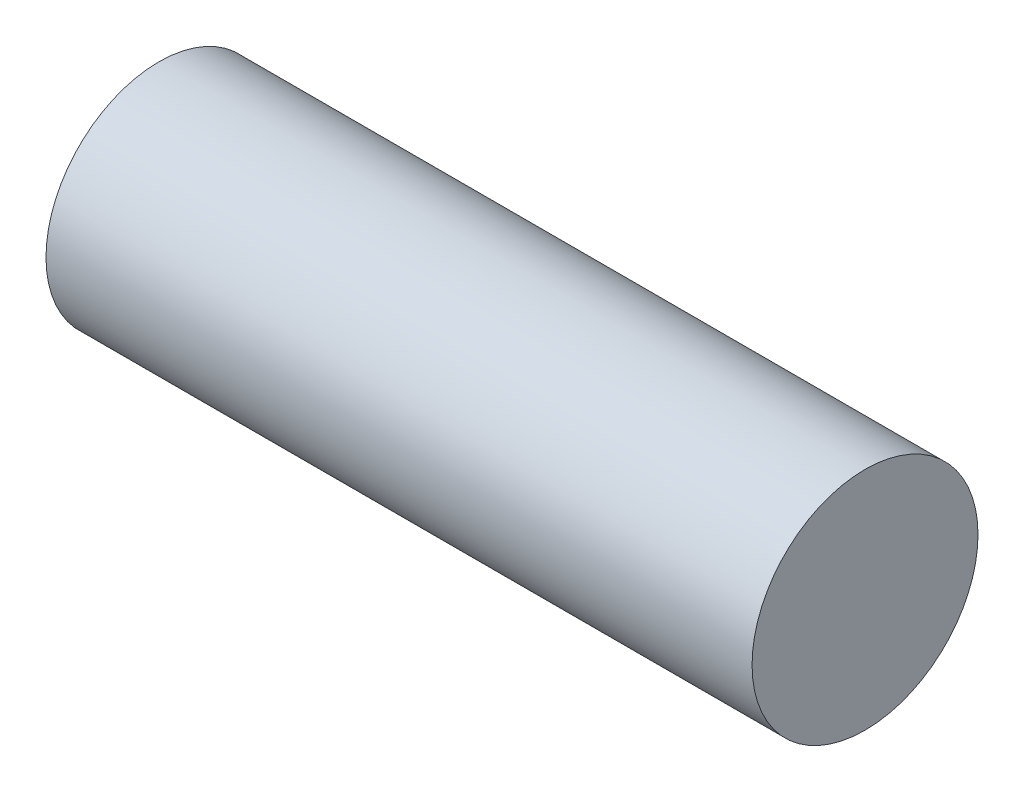
ISO-10303-21;
HEADER;
FILE_DESCRIPTION(('STEP AP214'),'2;1');
FILE_NAME('part.step','',(''),(''),'','','');
FILE_SCHEMA(('AUTOMOTIVE_DESIGN { 1 0 10303 214 1 1 1 1 }'));
ENDSEC;
DATA;
#1=APPLICATION_CONTEXT('core data for automotive mechanical design processes');
#2=APPLICATION_PROTOCOL_DEFINITION('international standard','automotive_design',2000,#1);
#3=PRODUCT_CONTEXT('',#1,'mechanical');
#4=PRODUCT('Part','Part','',(#3));
#5=PRODUCT_RELATED_PRODUCT_CATEGORY('part','',(#4));
#6=PRODUCT_DEFINITION_FORMATION('','',#4);
#7=PRODUCT_DEFINITION_CONTEXT('part definition',#1,'design');
#8=PRODUCT_DEFINITION('design','',#6,#7);
#9=PRODUCT_DEFINITION_SHAPE('','',#8);
#10=(LENGTH_UNIT() NAMED_UNIT(*) SI_UNIT(.MILLI.,.METRE.));
#11=(NAMED_UNIT(*) PLANE_ANGLE_UNIT() SI_UNIT($,.RADIAN.));
#12=(NAMED_UNIT(*) SI_UNIT($,.STERADIAN.) SOLID_ANGLE_UNIT());
#13=UNCERTAINTY_MEASURE_WITH_UNIT(LENGTH_MEASURE(1.E-05),#10,'distance_accuracy_value','');
#14=(GEOMETRIC_REPRESENTATION_CONTEXT(3) GLOBAL_UNCERTAINTY_ASSIGNED_CONTEXT((#13)) GLOBAL_UNIT_ASSIGNED_CONTEXT((#10,
#11,#12)) REPRESENTATION_CONTEXT('',''));
#15=CARTESIAN_POINT('',(0.,0.,0.));
#16=DIRECTION('',(0.,0.,1.));
#17=DIRECTION('',(1.,0.,0.));
#18=AXIS2_PLACEMENT_3D('',#15,#16,#17);
#19=CARTESIAN_POINT('',(25.,0.,0.));
#20=DIRECTION('',(-1.,0.,0.));
#21=DIRECTION('',(0.,0.,1.));
#22=AXIS2_PLACEMENT_3D('',#19,#20,#21);
#23=CYLINDRICAL_SURFACE('',#22,4.);
#24=CARTESIAN_POINT('',(25.,0.,0.));
#25=DIRECTION('',(1.,0.,0.));
#26=DIRECTION('',(0.,0.,-1.));
#27=AXIS2_PLACEMENT_3D('',#24,#25,#26);
#28=CIRCLE('',#27,4.);
#29=CARTESIAN_POINT('',(25.,0.,-4.));
#30=VERTEX_POINT('',#29);
#31=EDGE_CURVE('E10',#30,#30,#28,.T.);
#32=ORIENTED_EDGE('',*,*,#31,.F.);
#33=EDGE_LOOP('',(#32));
#34=FACE_BOUND('',#33,.T.);
#35=CARTESIAN_POINT('',(0.,0.,0.));
#36=DIRECTION('',(1.,0.,0.));
#37=DIRECTION('',(0.,0.,-1.));
#38=AXIS2_PLACEMENT_3D('',#35,#36,#37);
#39=CIRCLE('',#38,4.);
#40=CARTESIAN_POINT('',(0.,0.,-4.));
#41=VERTEX_POINT('',#40);
#42=EDGE_CURVE('E34',#41,#41,#39,.T.);
#43=ORIENTED_EDGE('',*,*,#42,.T.);
#44=EDGE_LOOP('',(#43));
#45=FACE_BOUND('',#44,.T.);
#46=ADVANCED_FACE('F31',(#34,#45),#23,.T.);
#47=CARTESIAN_POINT('',(25.,0.,0.));
#48=DIRECTION('',(1.,0.,0.));
#49=DIRECTION('',(0.,0.,-1.));
#50=AXIS2_PLACEMENT_3D('',#47,#48,#49);
#51=PLANE('',#50);
#52=ORIENTED_EDGE('',*,*,#31,.T.);
#53=EDGE_LOOP('',(#52));
#54=FACE_BOUND('',#53,.T.);
#55=ADVANCED_FACE('F46',(#54),#51,.T.);
#56=CARTESIAN_POINT('',(0.,0.,0.));
#57=DIRECTION('',(1.,0.,0.));
#58=DIRECTION('',(0.,0.,-1.));
#59=AXIS2_PLACEMENT_3D('',#56,#57,#58);
#60=PLANE('',#59);
#61=ORIENTED_EDGE('',*,*,#42,.F.);
#62=EDGE_LOOP('',(#61));
#63=FACE_BOUND('',#62,.T.);
#64=ADVANCED_FACE('F44',(#63),#60,.F.);
#65=CLOSED_SHELL('',(#46,#55,#64));
#66=MANIFOLD_SOLID_BREP('B2',#65);
#67=ADVANCED_BREP_SHAPE_REPRESENTATION('',(#18,#66),#14);
#68=SHAPE_DEFINITION_REPRESENTATION(#9,#67);
ENDSEC;
END-ISO-10303-21;
